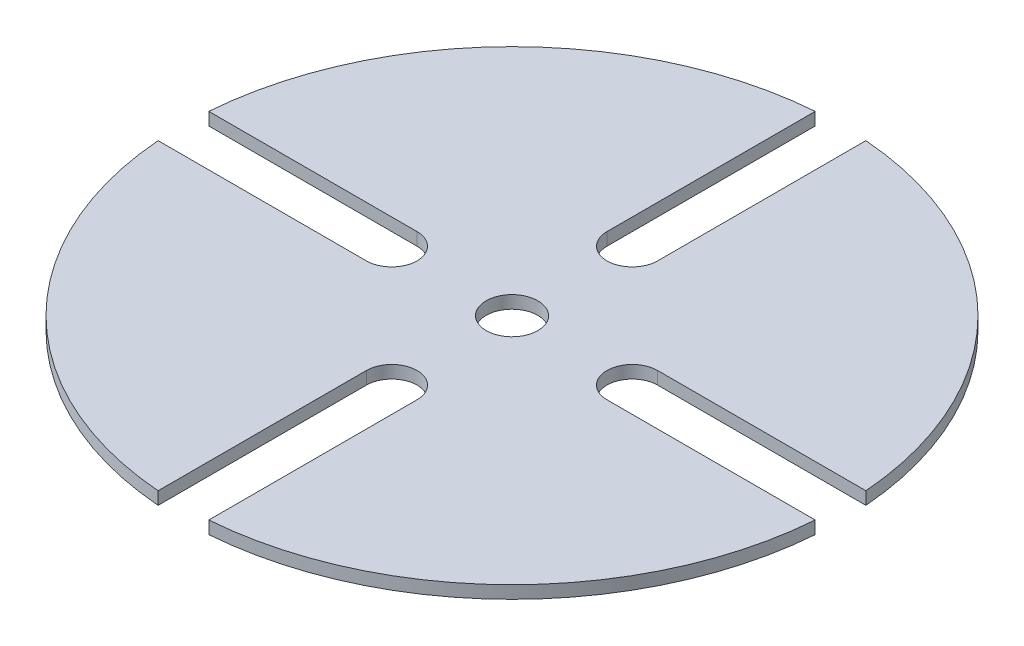
ISO-10303-21;
HEADER;
FILE_DESCRIPTION(('STEP AP214'),'2;1');
FILE_NAME('part.step','',(''),(''),'','','');
FILE_SCHEMA(('AUTOMOTIVE_DESIGN { 1 0 10303 214 1 1 1 1 }'));
ENDSEC;
DATA;
#1=APPLICATION_CONTEXT('core data for automotive mechanical design processes');
#2=APPLICATION_PROTOCOL_DEFINITION('international standard','automotive_design',2000,#1);
#3=PRODUCT_CONTEXT('',#1,'mechanical');
#4=PRODUCT('Part','Part','',(#3));
#5=PRODUCT_RELATED_PRODUCT_CATEGORY('part','',(#4));
#6=PRODUCT_DEFINITION_FORMATION('','',#4);
#7=PRODUCT_DEFINITION_CONTEXT('part definition',#1,'design');
#8=PRODUCT_DEFINITION('design','',#6,#7);
#9=PRODUCT_DEFINITION_SHAPE('','',#8);
#10=(LENGTH_UNIT() NAMED_UNIT(*) SI_UNIT(.MILLI.,.METRE.));
#11=(NAMED_UNIT(*) PLANE_ANGLE_UNIT() SI_UNIT($,.RADIAN.));
#12=(NAMED_UNIT(*) SI_UNIT($,.STERADIAN.) SOLID_ANGLE_UNIT());
#13=UNCERTAINTY_MEASURE_WITH_UNIT(LENGTH_MEASURE(1.E-05),#10,'distance_accuracy_value','');
#14=(GEOMETRIC_REPRESENTATION_CONTEXT(3) GLOBAL_UNCERTAINTY_ASSIGNED_CONTEXT((#13)) GLOBAL_UNIT_ASSIGNED_CONTEXT((#10,
#11,#12)) REPRESENTATION_CONTEXT('',''));
#15=CARTESIAN_POINT('',(0.,0.,0.));
#16=DIRECTION('',(0.,0.,1.));
#17=DIRECTION('',(1.,0.,0.));
#18=AXIS2_PLACEMENT_3D('',#15,#16,#17);
#19=CARTESIAN_POINT('',(-94.293901082123,39.04234,0.));
#20=DIRECTION('',(0.,-1.,0.));
#21=DIRECTION('',(0.,0.,-1.));
#22=AXIS2_PLACEMENT_3D('',#19,#20,#21);
#23=CYLINDRICAL_SURFACE('',#22,82.55);
#24=CARTESIAN_POINT('',(-94.293901082123,35.86734,0.));
#25=DIRECTION('',(0.,1.,0.));
#26=DIRECTION('',(0.,0.,1.));
#27=AXIS2_PLACEMENT_3D('',#24,#25,#26);
#28=CIRCLE('',#27,82.55);
#29=CARTESIAN_POINT('',(-100.643901082123,35.86734,-82.3054068697798));
#30=VERTEX_POINT('',#29);
#31=CARTESIAN_POINT('',(-176.599307951903,35.86734,-6.34999999999999));
#32=VERTEX_POINT('',#31);
#33=EDGE_CURVE('E183',#30,#32,#28,.T.);
#34=ORIENTED_EDGE('',*,*,#33,.T.);
#35=DIRECTION('',(0.,-1.,0.));
#36=VECTOR('',#35,1.);
#37=CARTESIAN_POINT('',(-176.599307951903,39.04234,-6.34999999999999));
#38=LINE('',#37,#36);
#39=CARTESIAN_POINT('',(-176.599307951903,39.04234,-6.34999999999999));
#40=VERTEX_POINT('',#39);
#41=EDGE_CURVE('E11',#40,#32,#38,.T.);
#42=ORIENTED_EDGE('',*,*,#41,.F.);
#43=CARTESIAN_POINT('',(-94.293901082123,39.04234,0.));
#44=DIRECTION('',(0.,1.,0.));
#45=DIRECTION('',(0.,0.,1.));
#46=AXIS2_PLACEMENT_3D('',#43,#44,#45);
#47=CIRCLE('',#46,82.55);
#48=CARTESIAN_POINT('',(-100.643901082123,39.04234,-82.3054068697798));
#49=VERTEX_POINT('',#48);
#50=EDGE_CURVE('E214',#49,#40,#47,.T.);
#51=ORIENTED_EDGE('',*,*,#50,.F.);
#52=DIRECTION('',(0.,-1.,0.));
#53=VECTOR('',#52,1.);
#54=CARTESIAN_POINT('',(-100.643901082123,39.04234,-82.3054068697798));
#55=LINE('',#54,#53);
#56=EDGE_CURVE('E179',#49,#30,#55,.T.);
#57=ORIENTED_EDGE('',*,*,#56,.T.);
#58=EDGE_LOOP('',(#34,#42,#51,#57));
#59=FACE_BOUND('',#58,.T.);
#60=ADVANCED_FACE('F39',(#59),#23,.T.);
#61=CARTESIAN_POINT('',(-176.599307951903,39.04234,-6.34999999999999));
#62=DIRECTION('',(0.,0.,-1.));
#63=DIRECTION('',(-1.,0.,0.));
#64=AXIS2_PLACEMENT_3D('',#61,#62,#63);
#65=PLANE('',#64);
#66=DIRECTION('',(1.,0.,0.));
#67=VECTOR('',#66,1.);
#68=CARTESIAN_POINT('',(-176.599307951903,35.86734,-6.34999999999999));
#69=LINE('',#68,#67);
#70=CARTESIAN_POINT('',(-124.42597442359,35.86734,-6.34999999999999));
#71=VERTEX_POINT('',#70);
#72=EDGE_CURVE('E186',#32,#71,#69,.T.);
#73=ORIENTED_EDGE('',*,*,#72,.T.);
#74=DIRECTION('',(0.,-1.,0.));
#75=VECTOR('',#74,1.);
#76=CARTESIAN_POINT('',(-124.42597442359,39.04234,-6.34999999999999));
#77=LINE('',#76,#75);
#78=CARTESIAN_POINT('',(-124.42597442359,39.04234,-6.34999999999999));
#79=VERTEX_POINT('',#78);
#80=EDGE_CURVE('E47',#79,#71,#77,.T.);
#81=ORIENTED_EDGE('',*,*,#80,.F.);
#82=DIRECTION('',(1.,0.,0.));
#83=VECTOR('',#82,1.);
#84=CARTESIAN_POINT('',(-176.599307951903,39.04234,-6.34999999999999));
#85=LINE('',#84,#83);
#86=EDGE_CURVE('E122',#40,#79,#85,.T.);
#87=ORIENTED_EDGE('',*,*,#86,.F.);
#88=ORIENTED_EDGE('',*,*,#41,.T.);
#89=EDGE_LOOP('',(#73,#81,#87,#88));
#90=FACE_BOUND('',#89,.T.);
#91=ADVANCED_FACE('F313',(#90),#65,.F.);
#92=CARTESIAN_POINT('',(-124.42597442359,39.04234,0.));
#93=DIRECTION('',(0.,-1.,0.));
#94=DIRECTION('',(0.,0.,-1.));
#95=AXIS2_PLACEMENT_3D('',#92,#93,#94);
#96=CYLINDRICAL_SURFACE('',#95,6.35);
#97=CARTESIAN_POINT('',(-124.42597442359,35.86734,0.));
#98=DIRECTION('',(0.,-1.,0.));
#99=DIRECTION('',(0.,0.,1.));
#100=AXIS2_PLACEMENT_3D('',#97,#98,#99);
#101=CIRCLE('',#100,6.35);
#102=CARTESIAN_POINT('',(-124.42597442359,35.86734,6.35000000000001));
#103=VERTEX_POINT('',#102);
#104=EDGE_CURVE('E189',#71,#103,#101,.T.);
#105=ORIENTED_EDGE('',*,*,#104,.T.);
#106=DIRECTION('',(0.,-1.,0.));
#107=VECTOR('',#106,1.);
#108=CARTESIAN_POINT('',(-124.42597442359,39.04234,6.35000000000001));
#109=LINE('',#108,#107);
#110=CARTESIAN_POINT('',(-124.42597442359,39.04234,6.35000000000001));
#111=VERTEX_POINT('',#110);
#112=EDGE_CURVE('E245',#111,#103,#109,.T.);
#113=ORIENTED_EDGE('',*,*,#112,.F.);
#114=CARTESIAN_POINT('',(-124.42597442359,39.04234,0.));
#115=DIRECTION('',(0.,-1.,0.));
#116=DIRECTION('',(0.,0.,1.));
#117=AXIS2_PLACEMENT_3D('',#114,#115,#116);
#118=CIRCLE('',#117,6.35);
#119=EDGE_CURVE('E253',#79,#111,#118,.T.);
#120=ORIENTED_EDGE('',*,*,#119,.F.);
#121=ORIENTED_EDGE('',*,*,#80,.T.);
#122=EDGE_LOOP('',(#105,#113,#120,#121));
#123=FACE_BOUND('',#122,.T.);
#124=ADVANCED_FACE('F251',(#123),#96,.F.);
#125=CARTESIAN_POINT('',(-176.599307951903,39.04234,6.34999999999997));
#126=DIRECTION('',(0.,0.,1.));
#127=DIRECTION('',(1.,0.,0.));
#128=AXIS2_PLACEMENT_3D('',#125,#126,#127);
#129=PLANE('',#128);
#130=DIRECTION('',(-1.,0.,0.));
#131=VECTOR('',#130,1.);
#132=CARTESIAN_POINT('',(-176.599307951903,35.86734,6.34999999999997));
#133=LINE('',#132,#131);
#134=CARTESIAN_POINT('',(-176.599307951903,35.86734,6.34999999999993));
#135=VERTEX_POINT('',#134);
#136=EDGE_CURVE('E191',#103,#135,#133,.T.);
#137=ORIENTED_EDGE('',*,*,#136,.T.);
#138=DIRECTION('',(0.,-1.,0.));
#139=VECTOR('',#138,1.);
#140=CARTESIAN_POINT('',(-176.599307951903,39.04234,6.34999999999993));
#141=LINE('',#140,#139);
#142=CARTESIAN_POINT('',(-176.599307951903,39.04234,6.34999999999993));
#143=VERTEX_POINT('',#142);
#144=EDGE_CURVE('E242',#143,#135,#141,.T.);
#145=ORIENTED_EDGE('',*,*,#144,.F.);
#146=DIRECTION('',(-1.,0.,0.));
#147=VECTOR('',#146,1.);
#148=CARTESIAN_POINT('',(-176.599307951903,39.04234,6.34999999999997));
#149=LINE('',#148,#147);
#150=EDGE_CURVE('E271',#111,#143,#149,.T.);
#151=ORIENTED_EDGE('',*,*,#150,.F.);
#152=ORIENTED_EDGE('',*,*,#112,.T.);
#153=EDGE_LOOP('',(#137,#145,#151,#152));
#154=FACE_BOUND('',#153,.T.);
#155=ADVANCED_FACE('F262',(#154),#129,.F.);
#156=CARTESIAN_POINT('',(-94.293901082123,39.04234,0.));
#157=DIRECTION('',(0.,-1.,0.));
#158=DIRECTION('',(0.,0.,-1.));
#159=AXIS2_PLACEMENT_3D('',#156,#157,#158);
#160=CYLINDRICAL_SURFACE('',#159,82.55);
#161=CARTESIAN_POINT('',(-94.293901082123,35.86734,0.));
#162=DIRECTION('',(0.,1.,0.));
#163=DIRECTION('',(0.,0.,1.));
#164=AXIS2_PLACEMENT_3D('',#161,#162,#163);
#165=CIRCLE('',#164,82.55);
#166=CARTESIAN_POINT('',(-100.643901082123,35.86734,82.3054068697798));
#167=VERTEX_POINT('',#166);
#168=EDGE_CURVE('E193',#135,#167,#165,.T.);
#169=ORIENTED_EDGE('',*,*,#168,.T.);
#170=DIRECTION('',(0.,-1.,0.));
#171=VECTOR('',#170,1.);
#172=CARTESIAN_POINT('',(-100.643901082123,39.04234,82.3054068697798));
#173=LINE('',#172,#171);
#174=CARTESIAN_POINT('',(-100.643901082123,39.04234,82.3054068697798));
#175=VERTEX_POINT('',#174);
#176=EDGE_CURVE('E239',#175,#167,#173,.T.);
#177=ORIENTED_EDGE('',*,*,#176,.F.);
#178=CARTESIAN_POINT('',(-94.293901082123,39.04234,0.));
#179=DIRECTION('',(0.,1.,0.));
#180=DIRECTION('',(0.,0.,1.));
#181=AXIS2_PLACEMENT_3D('',#178,#179,#180);
#182=CIRCLE('',#181,82.55);
#183=EDGE_CURVE('E268',#143,#175,#182,.T.);
#184=ORIENTED_EDGE('',*,*,#183,.F.);
#185=ORIENTED_EDGE('',*,*,#144,.T.);
#186=EDGE_LOOP('',(#169,#177,#184,#185));
#187=FACE_BOUND('',#186,.T.);
#188=ADVANCED_FACE('F266',(#187),#160,.T.);
#189=CARTESIAN_POINT('',(-100.643901082123,39.04234,30.1320733414675));
#190=DIRECTION('',(-1.,0.,0.));
#191=DIRECTION('',(0.,0.,1.));
#192=AXIS2_PLACEMENT_3D('',#189,#190,#191);
#193=PLANE('',#192);
#194=DIRECTION('',(0.,0.,-1.));
#195=VECTOR('',#194,1.);
#196=CARTESIAN_POINT('',(-100.643901082123,35.86734,30.1320733414675));
#197=LINE('',#196,#195);
#198=CARTESIAN_POINT('',(-100.643901082123,35.86734,30.1320733414675));
#199=VERTEX_POINT('',#198);
#200=EDGE_CURVE('E195',#167,#199,#197,.T.);
#201=ORIENTED_EDGE('',*,*,#200,.T.);
#202=DIRECTION('',(0.,-1.,0.));
#203=VECTOR('',#202,1.);
#204=CARTESIAN_POINT('',(-100.643901082123,39.04234,30.1320733414675));
#205=LINE('',#204,#203);
#206=CARTESIAN_POINT('',(-100.643901082123,39.04234,30.1320733414675));
#207=VERTEX_POINT('',#206);
#208=EDGE_CURVE('E236',#207,#199,#205,.T.);
#209=ORIENTED_EDGE('',*,*,#208,.F.);
#210=DIRECTION('',(0.,0.,-1.));
#211=VECTOR('',#210,1.);
#212=CARTESIAN_POINT('',(-100.643901082123,39.04234,30.1320733414675));
#213=LINE('',#212,#211);
#214=EDGE_CURVE('E270',#175,#207,#213,.T.);
#215=ORIENTED_EDGE('',*,*,#214,.F.);
#216=ORIENTED_EDGE('',*,*,#176,.T.);
#217=EDGE_LOOP('',(#201,#209,#215,#216));
#218=FACE_BOUND('',#217,.T.);
#219=ADVANCED_FACE('F326',(#218),#193,.F.);
#220=CARTESIAN_POINT('',(-94.293901082123,39.04234,30.1320733414675));
#221=DIRECTION('',(0.,-1.,0.));
#222=DIRECTION('',(0.,0.,-1.));
#223=AXIS2_PLACEMENT_3D('',#220,#221,#222);
#224=CYLINDRICAL_SURFACE('',#223,6.34999999999999);
#225=CARTESIAN_POINT('',(-94.293901082123,35.86734,30.1320733414675));
#226=DIRECTION('',(0.,-1.,0.));
#227=DIRECTION('',(0.,0.,1.));
#228=AXIS2_PLACEMENT_3D('',#225,#226,#227);
#229=CIRCLE('',#228,6.34999999999999);
#230=CARTESIAN_POINT('',(-87.943901082123,35.86734,30.1320733414675));
#231=VERTEX_POINT('',#230);
#232=EDGE_CURVE('E197',#199,#231,#229,.T.);
#233=ORIENTED_EDGE('',*,*,#232,.T.);
#234=DIRECTION('',(0.,-1.,0.));
#235=VECTOR('',#234,1.);
#236=CARTESIAN_POINT('',(-87.943901082123,39.04234,30.1320733414675));
#237=LINE('',#236,#235);
#238=CARTESIAN_POINT('',(-87.943901082123,39.04234,30.1320733414675));
#239=VERTEX_POINT('',#238);
#240=EDGE_CURVE('E233',#239,#231,#237,.T.);
#241=ORIENTED_EDGE('',*,*,#240,.F.);
#242=CARTESIAN_POINT('',(-94.293901082123,39.04234,30.1320733414675));
#243=DIRECTION('',(0.,-1.,0.));
#244=DIRECTION('',(0.,0.,1.));
#245=AXIS2_PLACEMENT_3D('',#242,#243,#244);
#246=CIRCLE('',#245,6.34999999999999);
#247=EDGE_CURVE('E273',#207,#239,#246,.T.);
#248=ORIENTED_EDGE('',*,*,#247,.F.);
#249=ORIENTED_EDGE('',*,*,#208,.T.);
#250=EDGE_LOOP('',(#233,#241,#248,#249));
#251=FACE_BOUND('',#250,.T.);
#252=ADVANCED_FACE('F329',(#251),#224,.F.);
#253=CARTESIAN_POINT('',(-87.943901082123,39.04234,30.1320733414675));
#254=DIRECTION('',(1.,0.,0.));
#255=DIRECTION('',(0.,0.,-1.));
#256=AXIS2_PLACEMENT_3D('',#253,#254,#255);
#257=PLANE('',#256);
#258=DIRECTION('',(0.,0.,1.));
#259=VECTOR('',#258,1.);
#260=CARTESIAN_POINT('',(-87.943901082123,35.86734,30.1320733414675));
#261=LINE('',#260,#259);
#262=CARTESIAN_POINT('',(-87.943901082123,35.86734,82.3054068697798));
#263=VERTEX_POINT('',#262);
#264=EDGE_CURVE('E199',#231,#263,#261,.T.);
#265=ORIENTED_EDGE('',*,*,#264,.T.);
#266=DIRECTION('',(0.,-1.,0.));
#267=VECTOR('',#266,1.);
#268=CARTESIAN_POINT('',(-87.943901082123,39.04234,82.3054068697798));
#269=LINE('',#268,#267);
#270=CARTESIAN_POINT('',(-87.943901082123,39.04234,82.3054068697798));
#271=VERTEX_POINT('',#270);
#272=EDGE_CURVE('E230',#271,#263,#269,.T.);
#273=ORIENTED_EDGE('',*,*,#272,.F.);
#274=DIRECTION('',(0.,0.,1.));
#275=VECTOR('',#274,1.);
#276=CARTESIAN_POINT('',(-87.943901082123,39.04234,30.1320733414675));
#277=LINE('',#276,#275);
#278=EDGE_CURVE('E279',#239,#271,#277,.T.);
#279=ORIENTED_EDGE('',*,*,#278,.F.);
#280=ORIENTED_EDGE('',*,*,#240,.T.);
#281=EDGE_LOOP('',(#265,#273,#279,#280));
#282=FACE_BOUND('',#281,.T.);
#283=ADVANCED_FACE('F333',(#282),#257,.F.);
#284=CARTESIAN_POINT('',(-94.293901082123,39.04234,0.));
#285=DIRECTION('',(0.,-1.,0.));
#286=DIRECTION('',(0.,0.,-1.));
#287=AXIS2_PLACEMENT_3D('',#284,#285,#286);
#288=CYLINDRICAL_SURFACE('',#287,82.55);
#289=CARTESIAN_POINT('',(-94.293901082123,35.86734,0.));
#290=DIRECTION('',(0.,1.,0.));
#291=DIRECTION('',(0.,0.,1.));
#292=AXIS2_PLACEMENT_3D('',#289,#290,#291);
#293=CIRCLE('',#292,82.55);
#294=CARTESIAN_POINT('',(-11.9884942123431,35.86734,6.35000000000004));
#295=VERTEX_POINT('',#294);
#296=EDGE_CURVE('E201',#263,#295,#293,.T.);
#297=ORIENTED_EDGE('',*,*,#296,.T.);
#298=DIRECTION('',(0.,-1.,0.));
#299=VECTOR('',#298,1.);
#300=CARTESIAN_POINT('',(-11.9884942123431,39.04234,6.35000000000004));
#301=LINE('',#300,#299);
#302=CARTESIAN_POINT('',(-11.9884942123431,39.04234,6.35000000000004));
#303=VERTEX_POINT('',#302);
#304=EDGE_CURVE('E227',#303,#295,#301,.T.);
#305=ORIENTED_EDGE('',*,*,#304,.F.);
#306=CARTESIAN_POINT('',(-94.293901082123,39.04234,0.));
#307=DIRECTION('',(0.,1.,0.));
#308=DIRECTION('',(0.,0.,1.));
#309=AXIS2_PLACEMENT_3D('',#306,#307,#308);
#310=CIRCLE('',#309,82.55);
#311=EDGE_CURVE('E281',#271,#303,#310,.T.);
#312=ORIENTED_EDGE('',*,*,#311,.F.);
#313=ORIENTED_EDGE('',*,*,#272,.T.);
#314=EDGE_LOOP('',(#297,#305,#312,#313));
#315=FACE_BOUND('',#314,.T.);
#316=ADVANCED_FACE('F337',(#315),#288,.T.);
#317=CARTESIAN_POINT('',(-64.1618277406555,39.04234,6.35));
#318=DIRECTION('',(0.,0.,1.));
#319=DIRECTION('',(1.,0.,0.));
#320=AXIS2_PLACEMENT_3D('',#317,#318,#319);
#321=PLANE('',#320);
#322=DIRECTION('',(-1.,0.,0.));
#323=VECTOR('',#322,1.);
#324=CARTESIAN_POINT('',(-64.1618277406555,35.86734,6.35));
#325=LINE('',#324,#323);
#326=CARTESIAN_POINT('',(-64.1618277406555,35.86734,6.35));
#327=VERTEX_POINT('',#326);
#328=EDGE_CURVE('E203',#295,#327,#325,.T.);
#329=ORIENTED_EDGE('',*,*,#328,.T.);
#330=DIRECTION('',(0.,-1.,0.));
#331=VECTOR('',#330,1.);
#332=CARTESIAN_POINT('',(-64.1618277406555,39.04234,6.35));
#333=LINE('',#332,#331);
#334=CARTESIAN_POINT('',(-64.1618277406555,39.04234,6.35));
#335=VERTEX_POINT('',#334);
#336=EDGE_CURVE('E224',#335,#327,#333,.T.);
#337=ORIENTED_EDGE('',*,*,#336,.F.);
#338=DIRECTION('',(-1.,0.,0.));
#339=VECTOR('',#338,1.);
#340=CARTESIAN_POINT('',(-64.1618277406555,39.04234,6.35));
#341=LINE('',#340,#339);
#342=EDGE_CURVE('E283',#303,#335,#341,.T.);
#343=ORIENTED_EDGE('',*,*,#342,.F.);
#344=ORIENTED_EDGE('',*,*,#304,.T.);
#345=EDGE_LOOP('',(#329,#337,#343,#344));
#346=FACE_BOUND('',#345,.T.);
#347=ADVANCED_FACE('F341',(#346),#321,.F.);
#348=CARTESIAN_POINT('',(-64.1618277406555,39.04234,0.));
#349=DIRECTION('',(0.,-1.,0.));
#350=DIRECTION('',(0.,0.,-1.));
#351=AXIS2_PLACEMENT_3D('',#348,#349,#350);
#352=CYLINDRICAL_SURFACE('',#351,6.35);
#353=CARTESIAN_POINT('',(-64.1618277406555,35.86734,0.));
#354=DIRECTION('',(0.,-1.,0.));
#355=DIRECTION('',(0.,0.,1.));
#356=AXIS2_PLACEMENT_3D('',#353,#354,#355);
#357=CIRCLE('',#356,6.35);
#358=CARTESIAN_POINT('',(-64.1618277406555,35.86734,-6.35));
#359=VERTEX_POINT('',#358);
#360=EDGE_CURVE('E205',#327,#359,#357,.T.);
#361=ORIENTED_EDGE('',*,*,#360,.T.);
#362=DIRECTION('',(0.,-1.,0.));
#363=VECTOR('',#362,1.);
#364=CARTESIAN_POINT('',(-64.1618277406555,39.04234,-6.35));
#365=LINE('',#364,#363);
#366=CARTESIAN_POINT('',(-64.1618277406555,39.04234,-6.35));
#367=VERTEX_POINT('',#366);
#368=EDGE_CURVE('E221',#367,#359,#365,.T.);
#369=ORIENTED_EDGE('',*,*,#368,.F.);
#370=CARTESIAN_POINT('',(-64.1618277406555,39.04234,0.));
#371=DIRECTION('',(0.,-1.,0.));
#372=DIRECTION('',(0.,0.,1.));
#373=AXIS2_PLACEMENT_3D('',#370,#371,#372);
#374=CIRCLE('',#373,6.35);
#375=EDGE_CURVE('E285',#335,#367,#374,.T.);
#376=ORIENTED_EDGE('',*,*,#375,.F.);
#377=ORIENTED_EDGE('',*,*,#336,.T.);
#378=EDGE_LOOP('',(#361,#369,#376,#377));
#379=FACE_BOUND('',#378,.T.);
#380=ADVANCED_FACE('F345',(#379),#352,.F.);
#381=CARTESIAN_POINT('',(-64.1618277406555,39.04234,-6.35));
#382=DIRECTION('',(0.,0.,-1.));
#383=DIRECTION('',(-1.,0.,0.));
#384=AXIS2_PLACEMENT_3D('',#381,#382,#383);
#385=PLANE('',#384);
#386=DIRECTION('',(1.,0.,0.));
#387=VECTOR('',#386,1.);
#388=CARTESIAN_POINT('',(-64.1618277406555,35.86734,-6.35));
#389=LINE('',#388,#387);
#390=CARTESIAN_POINT('',(-11.9884942123431,35.86734,-6.34999999999999));
#391=VERTEX_POINT('',#390);
#392=EDGE_CURVE('E207',#359,#391,#389,.T.);
#393=ORIENTED_EDGE('',*,*,#392,.T.);
#394=DIRECTION('',(0.,-1.,0.));
#395=VECTOR('',#394,1.);
#396=CARTESIAN_POINT('',(-11.9884942123431,39.04234,-6.34999999999999));
#397=LINE('',#396,#395);
#398=CARTESIAN_POINT('',(-11.9884942123431,39.04234,-6.34999999999999));
#399=VERTEX_POINT('',#398);
#400=EDGE_CURVE('E218',#399,#391,#397,.T.);
#401=ORIENTED_EDGE('',*,*,#400,.F.);
#402=DIRECTION('',(1.,0.,0.));
#403=VECTOR('',#402,1.);
#404=CARTESIAN_POINT('',(-64.1618277406555,39.04234,-6.35));
#405=LINE('',#404,#403);
#406=EDGE_CURVE('E287',#367,#399,#405,.T.);
#407=ORIENTED_EDGE('',*,*,#406,.F.);
#408=ORIENTED_EDGE('',*,*,#368,.T.);
#409=EDGE_LOOP('',(#393,#401,#407,#408));
#410=FACE_BOUND('',#409,.T.);
#411=ADVANCED_FACE('F293',(#410),#385,.F.);
#412=CARTESIAN_POINT('',(-94.293901082123,39.04234,0.));
#413=DIRECTION('',(0.,-1.,0.));
#414=DIRECTION('',(0.,0.,-1.));
#415=AXIS2_PLACEMENT_3D('',#412,#413,#414);
#416=CYLINDRICAL_SURFACE('',#415,82.55);
#417=CARTESIAN_POINT('',(-94.293901082123,35.86734,0.));
#418=DIRECTION('',(0.,1.,0.));
#419=DIRECTION('',(0.,0.,1.));
#420=AXIS2_PLACEMENT_3D('',#417,#418,#419);
#421=CIRCLE('',#420,82.55);
#422=CARTESIAN_POINT('',(-87.9439010821229,35.86734,-82.3054068697798));
#423=VERTEX_POINT('',#422);
#424=EDGE_CURVE('E209',#391,#423,#421,.T.);
#425=ORIENTED_EDGE('',*,*,#424,.T.);
#426=DIRECTION('',(0.,-1.,0.));
#427=VECTOR('',#426,1.);
#428=CARTESIAN_POINT('',(-87.9439010821229,39.04234,-82.3054068697798));
#429=LINE('',#428,#427);
#430=CARTESIAN_POINT('',(-87.9439010821229,39.04234,-82.3054068697798));
#431=VERTEX_POINT('',#430);
#432=EDGE_CURVE('E174',#431,#423,#429,.T.);
#433=ORIENTED_EDGE('',*,*,#432,.F.);
#434=CARTESIAN_POINT('',(-94.293901082123,39.04234,0.));
#435=DIRECTION('',(0.,1.,0.));
#436=DIRECTION('',(0.,0.,1.));
#437=AXIS2_PLACEMENT_3D('',#434,#435,#436);
#438=CIRCLE('',#437,82.55);
#439=EDGE_CURVE('E165',#399,#431,#438,.T.);
#440=ORIENTED_EDGE('',*,*,#439,.F.);
#441=ORIENTED_EDGE('',*,*,#400,.T.);
#442=EDGE_LOOP('',(#425,#433,#440,#441));
#443=FACE_BOUND('',#442,.T.);
#444=ADVANCED_FACE('F297',(#443),#416,.T.);
#445=CARTESIAN_POINT('',(-87.943901082123,39.04234,-30.1320733414675));
#446=DIRECTION('',(1.,0.,0.));
#447=DIRECTION('',(0.,0.,-1.));
#448=AXIS2_PLACEMENT_3D('',#445,#446,#447);
#449=PLANE('',#448);
#450=DIRECTION('',(0.,0.,1.));
#451=VECTOR('',#450,1.);
#452=CARTESIAN_POINT('',(-87.943901082123,35.86734,-30.1320733414675));
#453=LINE('',#452,#451);
#454=CARTESIAN_POINT('',(-87.943901082123,35.86734,-30.1320733414675));
#455=VERTEX_POINT('',#454);
#456=EDGE_CURVE('E173',#423,#455,#453,.T.);
#457=ORIENTED_EDGE('',*,*,#456,.T.);
#458=DIRECTION('',(0.,-1.,0.));
#459=VECTOR('',#458,1.);
#460=CARTESIAN_POINT('',(-87.943901082123,39.04234,-30.1320733414675));
#461=LINE('',#460,#459);
#462=CARTESIAN_POINT('',(-87.943901082123,39.04234,-30.1320733414675));
#463=VERTEX_POINT('',#462);
#464=EDGE_CURVE('E170',#463,#455,#461,.T.);
#465=ORIENTED_EDGE('',*,*,#464,.F.);
#466=DIRECTION('',(0.,0.,1.));
#467=VECTOR('',#466,1.);
#468=CARTESIAN_POINT('',(-87.943901082123,39.04234,-30.1320733414675));
#469=LINE('',#468,#467);
#470=EDGE_CURVE('E159',#431,#463,#469,.T.);
#471=ORIENTED_EDGE('',*,*,#470,.F.);
#472=ORIENTED_EDGE('',*,*,#432,.T.);
#473=EDGE_LOOP('',(#457,#465,#471,#472));
#474=FACE_BOUND('',#473,.T.);
#475=ADVANCED_FACE('F171',(#474),#449,.F.);
#476=CARTESIAN_POINT('',(-94.293901082123,39.04234,-30.1320733414675));
#477=DIRECTION('',(0.,-1.,0.));
#478=DIRECTION('',(0.,0.,-1.));
#479=AXIS2_PLACEMENT_3D('',#476,#477,#478);
#480=CYLINDRICAL_SURFACE('',#479,6.34999999999999);
#481=CARTESIAN_POINT('',(-94.293901082123,35.86734,-30.1320733414675));
#482=DIRECTION('',(0.,-1.,0.));
#483=DIRECTION('',(0.,0.,1.));
#484=AXIS2_PLACEMENT_3D('',#481,#482,#483);
#485=CIRCLE('',#484,6.34999999999999);
#486=CARTESIAN_POINT('',(-100.643901082123,35.86734,-30.1320733414675));
#487=VERTEX_POINT('',#486);
#488=EDGE_CURVE('E108',#455,#487,#485,.T.);
#489=ORIENTED_EDGE('',*,*,#488,.T.);
#490=DIRECTION('',(0.,-1.,0.));
#491=VECTOR('',#490,1.);
#492=CARTESIAN_POINT('',(-100.643901082123,39.04234,-30.1320733414675));
#493=LINE('',#492,#491);
#494=CARTESIAN_POINT('',(-100.643901082123,39.04234,-30.1320733414675));
#495=VERTEX_POINT('',#494);
#496=EDGE_CURVE('E175',#495,#487,#493,.T.);
#497=ORIENTED_EDGE('',*,*,#496,.F.);
#498=CARTESIAN_POINT('',(-94.293901082123,39.04234,-30.1320733414675));
#499=DIRECTION('',(0.,-1.,0.));
#500=DIRECTION('',(0.,0.,1.));
#501=AXIS2_PLACEMENT_3D('',#498,#499,#500);
#502=CIRCLE('',#501,6.34999999999999);
#503=EDGE_CURVE('E163',#463,#495,#502,.T.);
#504=ORIENTED_EDGE('',*,*,#503,.F.);
#505=ORIENTED_EDGE('',*,*,#464,.T.);
#506=EDGE_LOOP('',(#489,#497,#504,#505));
#507=FACE_BOUND('',#506,.T.);
#508=ADVANCED_FACE('F177',(#507),#480,.F.);
#509=CARTESIAN_POINT('',(-100.643901082123,39.04234,-82.3054068697798));
#510=DIRECTION('',(-1.,0.,0.));
#511=DIRECTION('',(0.,0.,1.));
#512=AXIS2_PLACEMENT_3D('',#509,#510,#511);
#513=PLANE('',#512);
#514=DIRECTION('',(0.,0.,-1.));
#515=VECTOR('',#514,1.);
#516=CARTESIAN_POINT('',(-100.643901082123,35.86734,-82.3054068697798));
#517=LINE('',#516,#515);
#518=EDGE_CURVE('E114',#487,#30,#517,.T.);
#519=ORIENTED_EDGE('',*,*,#518,.T.);
#520=ORIENTED_EDGE('',*,*,#56,.F.);
#521=DIRECTION('',(0.,0.,-1.));
#522=VECTOR('',#521,1.);
#523=CARTESIAN_POINT('',(-100.643901082123,39.04234,-82.3054068697798));
#524=LINE('',#523,#522);
#525=EDGE_CURVE('E55',#495,#49,#524,.T.);
#526=ORIENTED_EDGE('',*,*,#525,.F.);
#527=ORIENTED_EDGE('',*,*,#496,.T.);
#528=EDGE_LOOP('',(#519,#520,#526,#527));
#529=FACE_BOUND('',#528,.T.);
#530=ADVANCED_FACE('F301',(#529),#513,.F.);
#531=CARTESIAN_POINT('',(-94.293901082123,39.04234,0.));
#532=DIRECTION('',(0.,1.,0.));
#533=DIRECTION('',(0.,0.,1.));
#534=AXIS2_PLACEMENT_3D('',#531,#532,#533);
#535=PLANE('',#534);
#536=CARTESIAN_POINT('',(-94.293901082123,39.04234,0.));
#537=DIRECTION('',(0.,1.,0.));
#538=DIRECTION('',(0.,0.,1.));
#539=AXIS2_PLACEMENT_3D('',#536,#537,#538);
#540=CIRCLE('',#539,6.477);
#541=CARTESIAN_POINT('',(-94.293901082123,39.04234,6.477));
#542=VERTEX_POINT('',#541);
#543=EDGE_CURVE('E399',#542,#542,#540,.T.);
#544=ORIENTED_EDGE('',*,*,#543,.F.);
#545=EDGE_LOOP('',(#544));
#546=FACE_BOUND('',#545,.T.);
#547=ORIENTED_EDGE('',*,*,#50,.T.);
#548=ORIENTED_EDGE('',*,*,#86,.T.);
#549=ORIENTED_EDGE('',*,*,#119,.T.);
#550=ORIENTED_EDGE('',*,*,#150,.T.);
#551=ORIENTED_EDGE('',*,*,#183,.T.);
#552=ORIENTED_EDGE('',*,*,#214,.T.);
#553=ORIENTED_EDGE('',*,*,#247,.T.);
#554=ORIENTED_EDGE('',*,*,#278,.T.);
#555=ORIENTED_EDGE('',*,*,#311,.T.);
#556=ORIENTED_EDGE('',*,*,#342,.T.);
#557=ORIENTED_EDGE('',*,*,#375,.T.);
#558=ORIENTED_EDGE('',*,*,#406,.T.);
#559=ORIENTED_EDGE('',*,*,#439,.T.);
#560=ORIENTED_EDGE('',*,*,#470,.T.);
#561=ORIENTED_EDGE('',*,*,#503,.T.);
#562=ORIENTED_EDGE('',*,*,#525,.T.);
#563=EDGE_LOOP('',(#547,#548,#549,#550,#551,#552,#553,#554,#555,#556,#557,#558,#559,#560,#561,#562));
#564=FACE_BOUND('',#563,.T.);
#565=ADVANCED_FACE('F161',(#546,#564),#535,.T.);
#566=CARTESIAN_POINT('',(-94.293901082123,35.86734,0.));
#567=DIRECTION('',(0.,1.,0.));
#568=DIRECTION('',(0.,0.,1.));
#569=AXIS2_PLACEMENT_3D('',#566,#567,#568);
#570=PLANE('',#569);
#571=CARTESIAN_POINT('',(-94.293901082123,35.86734,0.));
#572=DIRECTION('',(0.,1.,0.));
#573=DIRECTION('',(0.,0.,1.));
#574=AXIS2_PLACEMENT_3D('',#571,#572,#573);
#575=CIRCLE('',#574,6.477);
#576=CARTESIAN_POINT('',(-94.293901082123,35.86734,6.477));
#577=VERTEX_POINT('',#576);
#578=EDGE_CURVE('E187',#577,#577,#575,.F.);
#579=ORIENTED_EDGE('',*,*,#578,.F.);
#580=EDGE_LOOP('',(#579));
#581=FACE_BOUND('',#580,.T.);
#582=ORIENTED_EDGE('',*,*,#33,.F.);
#583=ORIENTED_EDGE('',*,*,#518,.F.);
#584=ORIENTED_EDGE('',*,*,#488,.F.);
#585=ORIENTED_EDGE('',*,*,#456,.F.);
#586=ORIENTED_EDGE('',*,*,#424,.F.);
#587=ORIENTED_EDGE('',*,*,#392,.F.);
#588=ORIENTED_EDGE('',*,*,#360,.F.);
#589=ORIENTED_EDGE('',*,*,#328,.F.);
#590=ORIENTED_EDGE('',*,*,#296,.F.);
#591=ORIENTED_EDGE('',*,*,#264,.F.);
#592=ORIENTED_EDGE('',*,*,#232,.F.);
#593=ORIENTED_EDGE('',*,*,#200,.F.);
#594=ORIENTED_EDGE('',*,*,#168,.F.);
#595=ORIENTED_EDGE('',*,*,#136,.F.);
#596=ORIENTED_EDGE('',*,*,#104,.F.);
#597=ORIENTED_EDGE('',*,*,#72,.F.);
#598=EDGE_LOOP('',(#582,#583,#584,#585,#586,#587,#588,#589,#590,#591,#592,#593,#594,#595,#596,#597));
#599=FACE_BOUND('',#598,.T.);
#600=ADVANCED_FACE('F257',(#581,#599),#570,.F.);
#601=CARTESIAN_POINT('',(-94.293901082123,35.86634,0.));
#602=DIRECTION('',(0.,1.,0.));
#603=DIRECTION('',(0.,0.,1.));
#604=AXIS2_PLACEMENT_3D('',#601,#602,#603);
#605=CYLINDRICAL_SURFACE('',#604,6.477);
#606=ORIENTED_EDGE('',*,*,#543,.T.);
#607=EDGE_LOOP('',(#606));
#608=FACE_BOUND('',#607,.T.);
#609=ORIENTED_EDGE('',*,*,#578,.T.);
#610=EDGE_LOOP('',(#609));
#611=FACE_BOUND('',#610,.T.);
#612=ADVANCED_FACE('F384',(#608,#611),#605,.F.);
#613=CLOSED_SHELL('',(#60,#91,#124,#155,#188,#219,#252,#283,#316,#347,#380,#411,#444,#475,#508,
#530,#565,#600,#612));
#614=MANIFOLD_SOLID_BREP('B2',#613);
#615=ADVANCED_BREP_SHAPE_REPRESENTATION('',(#18,#614),#14);
#616=SHAPE_DEFINITION_REPRESENTATION(#9,#615);
ENDSEC;
END-ISO-10303-21;
